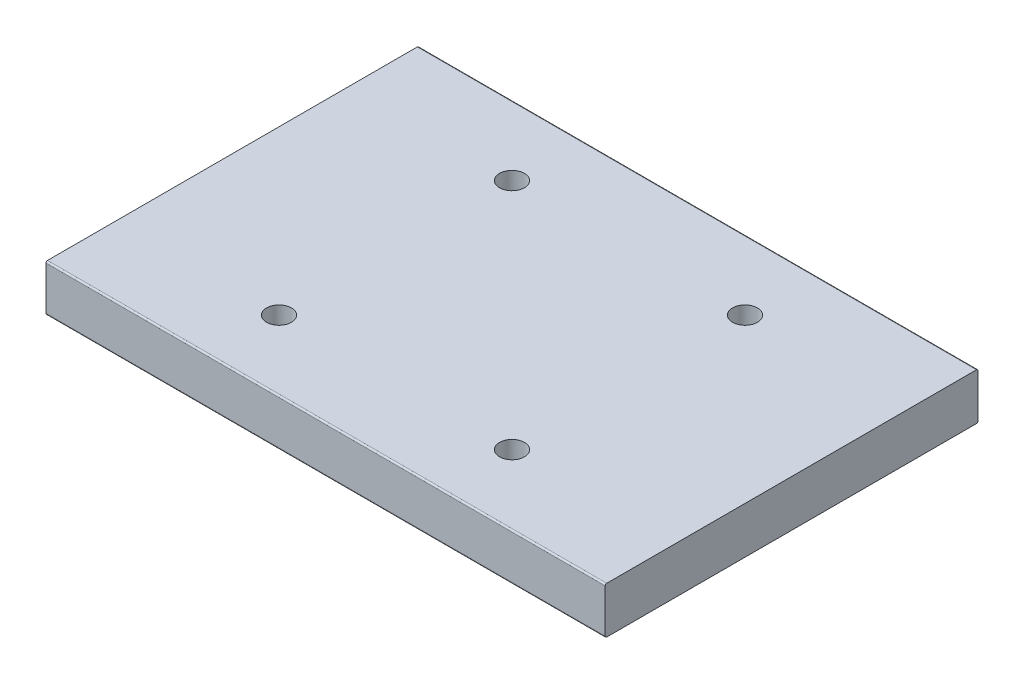
ISO-10303-21;
HEADER;
FILE_DESCRIPTION(('STEP AP214'),'2;1');
FILE_NAME('part.step','',(''),(''),'','','');
FILE_SCHEMA(('AUTOMOTIVE_DESIGN { 1 0 10303 214 1 1 1 1 }'));
ENDSEC;
DATA;
#1=APPLICATION_CONTEXT('core data for automotive mechanical design processes');
#2=APPLICATION_PROTOCOL_DEFINITION('international standard','automotive_design',2000,#1);
#3=PRODUCT_CONTEXT('',#1,'mechanical');
#4=PRODUCT('Part','Part','',(#3));
#5=PRODUCT_RELATED_PRODUCT_CATEGORY('part','',(#4));
#6=PRODUCT_DEFINITION_FORMATION('','',#4);
#7=PRODUCT_DEFINITION_CONTEXT('part definition',#1,'design');
#8=PRODUCT_DEFINITION('design','',#6,#7);
#9=PRODUCT_DEFINITION_SHAPE('','',#8);
#10=(LENGTH_UNIT() NAMED_UNIT(*) SI_UNIT(.MILLI.,.METRE.));
#11=(NAMED_UNIT(*) PLANE_ANGLE_UNIT() SI_UNIT($,.RADIAN.));
#12=(NAMED_UNIT(*) SI_UNIT($,.STERADIAN.) SOLID_ANGLE_UNIT());
#13=UNCERTAINTY_MEASURE_WITH_UNIT(LENGTH_MEASURE(1.E-05),#10,'distance_accuracy_value','');
#14=(GEOMETRIC_REPRESENTATION_CONTEXT(3) GLOBAL_UNCERTAINTY_ASSIGNED_CONTEXT((#13)) GLOBAL_UNIT_ASSIGNED_CONTEXT((#10,
#11,#12)) REPRESENTATION_CONTEXT('',''));
#15=CARTESIAN_POINT('',(0.,0.,0.));
#16=DIRECTION('',(0.,0.,1.));
#17=DIRECTION('',(1.,0.,0.));
#18=AXIS2_PLACEMENT_3D('',#15,#16,#17);
#19=CARTESIAN_POINT('',(-76.1999999999999,6.35,-50.8));
#20=DIRECTION('',(1.,0.,0.));
#21=DIRECTION('',(0.,0.,-1.));
#22=AXIS2_PLACEMENT_3D('',#19,#20,#21);
#23=PLANE('',#22);
#24=DIRECTION('',(0.,-1.,0.));
#25=VECTOR('',#24,1.);
#26=CARTESIAN_POINT('',(-76.1999999999999,6.35,-50.8));
#27=LINE('',#26,#25);
#28=CARTESIAN_POINT('',(-76.1999999999999,5.9309,-50.8));
#29=VERTEX_POINT('',#28);
#30=CARTESIAN_POINT('',(-76.1999999999999,-5.9309,-50.8));
#31=VERTEX_POINT('',#30);
#32=EDGE_CURVE('E121',#29,#31,#27,.T.);
#33=ORIENTED_EDGE('',*,*,#32,.T.);
#34=CARTESIAN_POINT('',(-76.1999999999999,-5.9309,-50.3809));
#35=DIRECTION('',(1.,0.,0.));
#36=DIRECTION('',(0.,0.,-1.));
#37=AXIS2_PLACEMENT_3D('',#34,#35,#36);
#38=CIRCLE('',#37,0.4191);
#39=CARTESIAN_POINT('',(-76.1999999999999,-6.35,-50.3809));
#40=VERTEX_POINT('',#39);
#41=EDGE_CURVE('E179',#31,#40,#38,.F.);
#42=ORIENTED_EDGE('',*,*,#41,.T.);
#43=DIRECTION('',(0.,0.,1.));
#44=VECTOR('',#43,1.);
#45=CARTESIAN_POINT('',(-76.1999999999999,-6.35,-50.8));
#46=LINE('',#45,#44);
#47=CARTESIAN_POINT('',(-76.1999999999999,-6.35,50.3809));
#48=VERTEX_POINT('',#47);
#49=EDGE_CURVE('E203',#40,#48,#46,.T.);
#50=ORIENTED_EDGE('',*,*,#49,.T.);
#51=CARTESIAN_POINT('',(-76.1999999999999,-5.9309,50.3809));
#52=DIRECTION('',(1.,0.,0.));
#53=DIRECTION('',(0.,0.,-1.));
#54=AXIS2_PLACEMENT_3D('',#51,#52,#53);
#55=CIRCLE('',#54,0.4191);
#56=CARTESIAN_POINT('',(-76.1999999999999,-5.9309,50.8));
#57=VERTEX_POINT('',#56);
#58=EDGE_CURVE('E166',#48,#57,#55,.F.);
#59=ORIENTED_EDGE('',*,*,#58,.T.);
#60=DIRECTION('',(0.,-1.,0.));
#61=VECTOR('',#60,1.);
#62=CARTESIAN_POINT('',(-76.1999999999999,6.35,50.8));
#63=LINE('',#62,#61);
#64=CARTESIAN_POINT('',(-76.1999999999999,5.9309,50.8));
#65=VERTEX_POINT('',#64);
#66=EDGE_CURVE('E125',#65,#57,#63,.T.);
#67=ORIENTED_EDGE('',*,*,#66,.F.);
#68=CARTESIAN_POINT('',(-76.1999999999999,5.9309,50.3809));
#69=DIRECTION('',(1.,0.,0.));
#70=DIRECTION('',(0.,0.,-1.));
#71=AXIS2_PLACEMENT_3D('',#68,#69,#70);
#72=CIRCLE('',#71,0.4191);
#73=CARTESIAN_POINT('',(-76.1999999999999,6.35,50.3809));
#74=VERTEX_POINT('',#73);
#75=EDGE_CURVE('E162',#65,#74,#72,.F.);
#76=ORIENTED_EDGE('',*,*,#75,.T.);
#77=DIRECTION('',(0.,0.,1.));
#78=VECTOR('',#77,1.);
#79=CARTESIAN_POINT('',(-76.1999999999999,6.35,-50.8));
#80=LINE('',#79,#78);
#81=CARTESIAN_POINT('',(-76.1999999999999,6.35,-50.3809));
#82=VERTEX_POINT('',#81);
#83=EDGE_CURVE('E191',#82,#74,#80,.T.);
#84=ORIENTED_EDGE('',*,*,#83,.F.);
#85=CARTESIAN_POINT('',(-76.1999999999999,5.9309,-50.3809));
#86=DIRECTION('',(1.,0.,0.));
#87=DIRECTION('',(0.,0.,-1.));
#88=AXIS2_PLACEMENT_3D('',#85,#86,#87);
#89=CIRCLE('',#88,0.4191);
#90=EDGE_CURVE('E173',#82,#29,#89,.F.);
#91=ORIENTED_EDGE('',*,*,#90,.T.);
#92=EDGE_LOOP('',(#33,#42,#50,#59,#67,#76,#84,#91));
#93=FACE_BOUND('',#92,.T.);
#94=ADVANCED_FACE('F45',(#93),#23,.F.);
#95=CARTESIAN_POINT('',(-76.1999999999999,6.35,50.8));
#96=DIRECTION('',(0.,0.,-1.));
#97=DIRECTION('',(-1.,0.,0.));
#98=AXIS2_PLACEMENT_3D('',#95,#96,#97);
#99=PLANE('',#98);
#100=ORIENTED_EDGE('',*,*,#66,.T.);
#101=DIRECTION('',(1.,0.,0.));
#102=VECTOR('',#101,1.);
#103=CARTESIAN_POINT('',(-76.1999999999999,-5.9309,50.8));
#104=LINE('',#103,#102);
#105=CARTESIAN_POINT('',(76.2,-5.9309,50.8));
#106=VERTEX_POINT('',#105);
#107=EDGE_CURVE('E11',#57,#106,#104,.T.);
#108=ORIENTED_EDGE('',*,*,#107,.T.);
#109=DIRECTION('',(0.,-1.,0.));
#110=VECTOR('',#109,1.);
#111=CARTESIAN_POINT('',(76.2,6.35,50.8));
#112=LINE('',#111,#110);
#113=CARTESIAN_POINT('',(76.2,5.9309,50.8));
#114=VERTEX_POINT('',#113);
#115=EDGE_CURVE('E132',#114,#106,#112,.T.);
#116=ORIENTED_EDGE('',*,*,#115,.F.);
#117=DIRECTION('',(1.,0.,0.));
#118=VECTOR('',#117,1.);
#119=CARTESIAN_POINT('',(-76.1999999999999,5.9309,50.8));
#120=LINE('',#119,#118);
#121=EDGE_CURVE('E54',#114,#65,#120,.F.);
#122=ORIENTED_EDGE('',*,*,#121,.T.);
#123=EDGE_LOOP('',(#100,#108,#116,#122));
#124=FACE_BOUND('',#123,.T.);
#125=ADVANCED_FACE('F156',(#124),#99,.F.);
#126=CARTESIAN_POINT('',(76.2,6.35,-50.8));
#127=DIRECTION('',(-1.,0.,0.));
#128=DIRECTION('',(0.,0.,1.));
#129=AXIS2_PLACEMENT_3D('',#126,#127,#128);
#130=PLANE('',#129);
#131=DIRECTION('',(0.,0.,-1.));
#132=VECTOR('',#131,1.);
#133=CARTESIAN_POINT('',(76.2,-6.35,-50.8));
#134=LINE('',#133,#132);
#135=CARTESIAN_POINT('',(76.2,-6.35,50.3809));
#136=VERTEX_POINT('',#135);
#137=CARTESIAN_POINT('',(76.2,-6.35,-50.3809));
#138=VERTEX_POINT('',#137);
#139=EDGE_CURVE('E196',#136,#138,#134,.T.);
#140=ORIENTED_EDGE('',*,*,#139,.T.);
#141=CARTESIAN_POINT('',(76.2,-5.9309,-50.3809));
#142=DIRECTION('',(-1.,0.,0.));
#143=DIRECTION('',(0.,0.,1.));
#144=AXIS2_PLACEMENT_3D('',#141,#142,#143);
#145=CIRCLE('',#144,0.4191);
#146=CARTESIAN_POINT('',(76.2,-5.9309,-50.8));
#147=VERTEX_POINT('',#146);
#148=EDGE_CURVE('E130',#138,#147,#145,.F.);
#149=ORIENTED_EDGE('',*,*,#148,.T.);
#150=DIRECTION('',(0.,-1.,0.));
#151=VECTOR('',#150,1.);
#152=CARTESIAN_POINT('',(76.2,6.35,-50.8));
#153=LINE('',#152,#151);
#154=CARTESIAN_POINT('',(76.2,5.9309,-50.8));
#155=VERTEX_POINT('',#154);
#156=EDGE_CURVE('E118',#155,#147,#153,.T.);
#157=ORIENTED_EDGE('',*,*,#156,.F.);
#158=CARTESIAN_POINT('',(76.2,5.9309,-50.3809));
#159=DIRECTION('',(-1.,0.,0.));
#160=DIRECTION('',(0.,0.,1.));
#161=AXIS2_PLACEMENT_3D('',#158,#159,#160);
#162=CIRCLE('',#161,0.4191);
#163=CARTESIAN_POINT('',(76.2,6.35,-50.3809));
#164=VERTEX_POINT('',#163);
#165=EDGE_CURVE('E61',#155,#164,#162,.F.);
#166=ORIENTED_EDGE('',*,*,#165,.T.);
#167=DIRECTION('',(0.,0.,-1.));
#168=VECTOR('',#167,1.);
#169=CARTESIAN_POINT('',(76.2,6.35,-50.8));
#170=LINE('',#169,#168);
#171=CARTESIAN_POINT('',(76.2,6.35,50.3809));
#172=VERTEX_POINT('',#171);
#173=EDGE_CURVE('E188',#172,#164,#170,.T.);
#174=ORIENTED_EDGE('',*,*,#173,.F.);
#175=CARTESIAN_POINT('',(76.2,5.9309,50.3809));
#176=DIRECTION('',(-1.,0.,0.));
#177=DIRECTION('',(0.,0.,1.));
#178=AXIS2_PLACEMENT_3D('',#175,#176,#177);
#179=CIRCLE('',#178,0.4191);
#180=EDGE_CURVE('E69',#172,#114,#179,.F.);
#181=ORIENTED_EDGE('',*,*,#180,.T.);
#182=ORIENTED_EDGE('',*,*,#115,.T.);
#183=CARTESIAN_POINT('',(76.2,-5.9309,50.3809));
#184=DIRECTION('',(-1.,0.,0.));
#185=DIRECTION('',(0.,0.,1.));
#186=AXIS2_PLACEMENT_3D('',#183,#184,#185);
#187=CIRCLE('',#186,0.4191);
#188=EDGE_CURVE('E139',#106,#136,#187,.F.);
#189=ORIENTED_EDGE('',*,*,#188,.T.);
#190=EDGE_LOOP('',(#140,#149,#157,#166,#174,#181,#182,#189));
#191=FACE_BOUND('',#190,.T.);
#192=ADVANCED_FACE('F128',(#191),#130,.F.);
#193=CARTESIAN_POINT('',(-76.1999999999999,6.35,-50.8));
#194=DIRECTION('',(0.,0.,1.));
#195=DIRECTION('',(1.,0.,0.));
#196=AXIS2_PLACEMENT_3D('',#193,#194,#195);
#197=PLANE('',#196);
#198=ORIENTED_EDGE('',*,*,#156,.T.);
#199=DIRECTION('',(-1.,0.,0.));
#200=VECTOR('',#199,1.);
#201=CARTESIAN_POINT('',(-76.1999999999999,-5.9309,-50.8));
#202=LINE('',#201,#200);
#203=EDGE_CURVE('E124',#147,#31,#202,.T.);
#204=ORIENTED_EDGE('',*,*,#203,.T.);
#205=ORIENTED_EDGE('',*,*,#32,.F.);
#206=DIRECTION('',(-1.,0.,0.));
#207=VECTOR('',#206,1.);
#208=CARTESIAN_POINT('',(76.2,5.9309,-50.8));
#209=LINE('',#208,#207);
#210=EDGE_CURVE('E115',#29,#155,#209,.F.);
#211=ORIENTED_EDGE('',*,*,#210,.T.);
#212=EDGE_LOOP('',(#198,#204,#205,#211));
#213=FACE_BOUND('',#212,.T.);
#214=ADVANCED_FACE('F116',(#213),#197,.F.);
#215=CARTESIAN_POINT('',(0.,6.35,0.));
#216=DIRECTION('',(0.,1.,0.));
#217=DIRECTION('',(0.,0.,1.));
#218=AXIS2_PLACEMENT_3D('',#215,#216,#217);
#219=PLANE('',#218);
#220=CARTESIAN_POINT('',(-31.7499999999997,6.35,-31.7500000000003));
#221=DIRECTION('',(0.,1.,0.));
#222=DIRECTION('',(0.,0.,1.));
#223=AXIS2_PLACEMENT_3D('',#220,#221,#222);
#224=CIRCLE('',#223,3.4036);
#225=CARTESIAN_POINT('',(-31.7499999999997,6.35,-28.3464000000003));
#226=VERTEX_POINT('',#225);
#227=EDGE_CURVE('E219',#226,#226,#224,.T.);
#228=ORIENTED_EDGE('',*,*,#227,.F.);
#229=EDGE_LOOP('',(#228));
#230=FACE_BOUND('',#229,.T.);
#231=CARTESIAN_POINT('',(-31.7500000000002,6.35,31.7499999999998));
#232=DIRECTION('',(0.,1.,0.));
#233=DIRECTION('',(0.,0.,1.));
#234=AXIS2_PLACEMENT_3D('',#231,#232,#233);
#235=CIRCLE('',#234,3.4036);
#236=CARTESIAN_POINT('',(-31.7500000000002,6.35,35.1535999999998));
#237=VERTEX_POINT('',#236);
#238=EDGE_CURVE('E227',#237,#237,#235,.T.);
#239=ORIENTED_EDGE('',*,*,#238,.F.);
#240=EDGE_LOOP('',(#239));
#241=FACE_BOUND('',#240,.T.);
#242=CARTESIAN_POINT('',(31.7499999999999,6.35,31.7500000000001));
#243=DIRECTION('',(0.,1.,0.));
#244=DIRECTION('',(0.,0.,1.));
#245=AXIS2_PLACEMENT_3D('',#242,#243,#244);
#246=CIRCLE('',#245,3.4036);
#247=CARTESIAN_POINT('',(31.7499999999999,6.35,35.1536000000001));
#248=VERTEX_POINT('',#247);
#249=EDGE_CURVE('E211',#248,#248,#246,.T.);
#250=ORIENTED_EDGE('',*,*,#249,.F.);
#251=EDGE_LOOP('',(#250));
#252=FACE_BOUND('',#251,.T.);
#253=CARTESIAN_POINT('',(31.75,6.35,-31.75));
#254=DIRECTION('',(0.,1.,0.));
#255=DIRECTION('',(0.,0.,1.));
#256=AXIS2_PLACEMENT_3D('',#253,#254,#255);
#257=CIRCLE('',#256,3.4036);
#258=CARTESIAN_POINT('',(31.75,6.35,-28.3464));
#259=VERTEX_POINT('',#258);
#260=EDGE_CURVE('E207',#259,#259,#257,.T.);
#261=ORIENTED_EDGE('',*,*,#260,.F.);
#262=EDGE_LOOP('',(#261));
#263=FACE_BOUND('',#262,.T.);
#264=ORIENTED_EDGE('',*,*,#173,.T.);
#265=DIRECTION('',(-1.,0.,0.));
#266=VECTOR('',#265,1.);
#267=CARTESIAN_POINT('',(-76.1999999999999,6.35,-50.3809));
#268=LINE('',#267,#266);
#269=EDGE_CURVE('E137',#164,#82,#268,.T.);
#270=ORIENTED_EDGE('',*,*,#269,.T.);
#271=ORIENTED_EDGE('',*,*,#83,.T.);
#272=DIRECTION('',(1.,0.,0.));
#273=VECTOR('',#272,1.);
#274=CARTESIAN_POINT('',(76.2,6.35,50.3809));
#275=LINE('',#274,#273);
#276=EDGE_CURVE('E143',#74,#172,#275,.T.);
#277=ORIENTED_EDGE('',*,*,#276,.T.);
#278=EDGE_LOOP('',(#264,#270,#271,#277));
#279=FACE_BOUND('',#278,.T.);
#280=ADVANCED_FACE('F241',(#230,#241,#252,#263,#279),#219,.T.);
#281=CARTESIAN_POINT('',(0.,-6.35,0.));
#282=DIRECTION('',(0.,1.,0.));
#283=DIRECTION('',(0.,0.,1.));
#284=AXIS2_PLACEMENT_3D('',#281,#282,#283);
#285=PLANE('',#284);
#286=CARTESIAN_POINT('',(-31.7499999999997,-6.35,-31.7500000000003));
#287=DIRECTION('',(0.,1.,0.));
#288=DIRECTION('',(0.,0.,1.));
#289=AXIS2_PLACEMENT_3D('',#286,#287,#288);
#290=CIRCLE('',#289,3.4036);
#291=CARTESIAN_POINT('',(-31.7499999999997,-6.35,-28.3464000000003));
#292=VERTEX_POINT('',#291);
#293=EDGE_CURVE('E215',#292,#292,#290,.T.);
#294=ORIENTED_EDGE('',*,*,#293,.T.);
#295=EDGE_LOOP('',(#294));
#296=FACE_BOUND('',#295,.T.);
#297=CARTESIAN_POINT('',(-31.7500000000002,-6.35,31.7499999999998));
#298=DIRECTION('',(0.,1.,0.));
#299=DIRECTION('',(0.,0.,1.));
#300=AXIS2_PLACEMENT_3D('',#297,#298,#299);
#301=CIRCLE('',#300,3.4036);
#302=CARTESIAN_POINT('',(-31.7500000000002,-6.35,35.1535999999998));
#303=VERTEX_POINT('',#302);
#304=EDGE_CURVE('E223',#303,#303,#301,.T.);
#305=ORIENTED_EDGE('',*,*,#304,.T.);
#306=EDGE_LOOP('',(#305));
#307=FACE_BOUND('',#306,.T.);
#308=CARTESIAN_POINT('',(31.7499999999999,-6.35,31.7500000000001));
#309=DIRECTION('',(0.,1.,0.));
#310=DIRECTION('',(0.,0.,1.));
#311=AXIS2_PLACEMENT_3D('',#308,#309,#310);
#312=CIRCLE('',#311,3.4036);
#313=CARTESIAN_POINT('',(31.7499999999999,-6.35,35.1536000000001));
#314=VERTEX_POINT('',#313);
#315=EDGE_CURVE('E231',#314,#314,#312,.T.);
#316=ORIENTED_EDGE('',*,*,#315,.T.);
#317=EDGE_LOOP('',(#316));
#318=FACE_BOUND('',#317,.T.);
#319=CARTESIAN_POINT('',(31.75,-6.35,-31.75));
#320=DIRECTION('',(0.,1.,0.));
#321=DIRECTION('',(0.,0.,1.));
#322=AXIS2_PLACEMENT_3D('',#319,#320,#321);
#323=CIRCLE('',#322,3.4036);
#324=CARTESIAN_POINT('',(31.75,-6.35,-28.3464));
#325=VERTEX_POINT('',#324);
#326=EDGE_CURVE('E206',#325,#325,#323,.T.);
#327=ORIENTED_EDGE('',*,*,#326,.T.);
#328=EDGE_LOOP('',(#327));
#329=FACE_BOUND('',#328,.T.);
#330=ORIENTED_EDGE('',*,*,#49,.F.);
#331=DIRECTION('',(-1.,0.,0.));
#332=VECTOR('',#331,1.);
#333=CARTESIAN_POINT('',(0.,-6.35,-50.3809));
#334=LINE('',#333,#332);
#335=EDGE_CURVE('E185',#40,#138,#334,.F.);
#336=ORIENTED_EDGE('',*,*,#335,.T.);
#337=ORIENTED_EDGE('',*,*,#139,.F.);
#338=DIRECTION('',(1.,0.,0.));
#339=VECTOR('',#338,1.);
#340=CARTESIAN_POINT('',(0.,-6.35,50.3809));
#341=LINE('',#340,#339);
#342=EDGE_CURVE('E182',#136,#48,#341,.F.);
#343=ORIENTED_EDGE('',*,*,#342,.T.);
#344=EDGE_LOOP('',(#330,#336,#337,#343));
#345=FACE_BOUND('',#344,.T.);
#346=ADVANCED_FACE('F244',(#296,#307,#318,#329,#345),#285,.F.);
#347=CARTESIAN_POINT('',(-76.1999999999999,-5.9309,-50.3809));
#348=DIRECTION('',(-1.,0.,0.));
#349=DIRECTION('',(0.,0.,1.));
#350=AXIS2_PLACEMENT_3D('',#347,#348,#349);
#351=CYLINDRICAL_SURFACE('',#350,0.4191);
#352=ORIENTED_EDGE('',*,*,#148,.F.);
#353=ORIENTED_EDGE('',*,*,#335,.F.);
#354=ORIENTED_EDGE('',*,*,#41,.F.);
#355=ORIENTED_EDGE('',*,*,#203,.F.);
#356=EDGE_LOOP('',(#352,#353,#354,#355));
#357=FACE_BOUND('',#356,.T.);
#358=ADVANCED_FACE('F273',(#357),#351,.T.);
#359=CARTESIAN_POINT('',(0.,5.9309,-50.3809));
#360=DIRECTION('',(1.,0.,0.));
#361=DIRECTION('',(0.,0.,-1.));
#362=AXIS2_PLACEMENT_3D('',#359,#360,#361);
#363=CYLINDRICAL_SURFACE('',#362,0.4191);
#364=ORIENTED_EDGE('',*,*,#165,.F.);
#365=ORIENTED_EDGE('',*,*,#210,.F.);
#366=ORIENTED_EDGE('',*,*,#90,.F.);
#367=ORIENTED_EDGE('',*,*,#269,.F.);
#368=EDGE_LOOP('',(#364,#365,#366,#367));
#369=FACE_BOUND('',#368,.T.);
#370=ADVANCED_FACE('F135',(#369),#363,.T.);
#371=CARTESIAN_POINT('',(-76.1999999999999,-5.9309,50.3809));
#372=DIRECTION('',(1.,0.,0.));
#373=DIRECTION('',(0.,0.,-1.));
#374=AXIS2_PLACEMENT_3D('',#371,#372,#373);
#375=CYLINDRICAL_SURFACE('',#374,0.4191);
#376=ORIENTED_EDGE('',*,*,#58,.F.);
#377=ORIENTED_EDGE('',*,*,#342,.F.);
#378=ORIENTED_EDGE('',*,*,#188,.F.);
#379=ORIENTED_EDGE('',*,*,#107,.F.);
#380=EDGE_LOOP('',(#376,#377,#378,#379));
#381=FACE_BOUND('',#380,.T.);
#382=ADVANCED_FACE('F261',(#381),#375,.T.);
#383=CARTESIAN_POINT('',(0.,5.9309,50.3809));
#384=DIRECTION('',(-1.,0.,0.));
#385=DIRECTION('',(0.,0.,1.));
#386=AXIS2_PLACEMENT_3D('',#383,#384,#385);
#387=CYLINDRICAL_SURFACE('',#386,0.4191);
#388=ORIENTED_EDGE('',*,*,#75,.F.);
#389=ORIENTED_EDGE('',*,*,#121,.F.);
#390=ORIENTED_EDGE('',*,*,#180,.F.);
#391=ORIENTED_EDGE('',*,*,#276,.F.);
#392=EDGE_LOOP('',(#388,#389,#390,#391));
#393=FACE_BOUND('',#392,.T.);
#394=ADVANCED_FACE('F47',(#393),#387,.T.);
#395=CARTESIAN_POINT('',(31.75,-6.35,-31.75));
#396=DIRECTION('',(0.,1.,0.));
#397=DIRECTION('',(0.,0.,1.));
#398=AXIS2_PLACEMENT_3D('',#395,#396,#397);
#399=CYLINDRICAL_SURFACE('',#398,3.4036);
#400=ORIENTED_EDGE('',*,*,#326,.F.);
#401=EDGE_LOOP('',(#400));
#402=FACE_BOUND('',#401,.T.);
#403=ORIENTED_EDGE('',*,*,#260,.T.);
#404=EDGE_LOOP('',(#403));
#405=FACE_BOUND('',#404,.T.);
#406=ADVANCED_FACE('F249',(#402,#405),#399,.F.);
#407=CARTESIAN_POINT('',(31.7499999999999,-6.35,31.7500000000001));
#408=DIRECTION('',(0.,1.,0.));
#409=DIRECTION('',(0.,0.,1.));
#410=AXIS2_PLACEMENT_3D('',#407,#408,#409);
#411=CYLINDRICAL_SURFACE('',#410,3.4036);
#412=ORIENTED_EDGE('',*,*,#315,.F.);
#413=EDGE_LOOP('',(#412));
#414=FACE_BOUND('',#413,.T.);
#415=ORIENTED_EDGE('',*,*,#249,.T.);
#416=EDGE_LOOP('',(#415));
#417=FACE_BOUND('',#416,.T.);
#418=ADVANCED_FACE('F239',(#414,#417),#411,.F.);
#419=CARTESIAN_POINT('',(-31.7500000000002,-6.35,31.7499999999998));
#420=DIRECTION('',(0.,1.,0.));
#421=DIRECTION('',(0.,0.,1.));
#422=AXIS2_PLACEMENT_3D('',#419,#420,#421);
#423=CYLINDRICAL_SURFACE('',#422,3.4036);
#424=ORIENTED_EDGE('',*,*,#304,.F.);
#425=EDGE_LOOP('',(#424));
#426=FACE_BOUND('',#425,.T.);
#427=ORIENTED_EDGE('',*,*,#238,.T.);
#428=EDGE_LOOP('',(#427));
#429=FACE_BOUND('',#428,.T.);
#430=ADVANCED_FACE('F257',(#426,#429),#423,.F.);
#431=CARTESIAN_POINT('',(-31.7499999999997,-6.35,-31.7500000000003));
#432=DIRECTION('',(0.,1.,0.));
#433=DIRECTION('',(0.,0.,1.));
#434=AXIS2_PLACEMENT_3D('',#431,#432,#433);
#435=CYLINDRICAL_SURFACE('',#434,3.4036);
#436=ORIENTED_EDGE('',*,*,#293,.F.);
#437=EDGE_LOOP('',(#436));
#438=FACE_BOUND('',#437,.T.);
#439=ORIENTED_EDGE('',*,*,#227,.T.);
#440=EDGE_LOOP('',(#439));
#441=FACE_BOUND('',#440,.T.);
#442=ADVANCED_FACE('F342',(#438,#441),#435,.F.);
#443=CLOSED_SHELL('',(#94,#125,#192,#214,#280,#346,#358,#370,#382,#394,#406,#418,#430,#442));
#444=MANIFOLD_SOLID_BREP('B2',#443);
#445=ADVANCED_BREP_SHAPE_REPRESENTATION('',(#18,#444),#14);
#446=SHAPE_DEFINITION_REPRESENTATION(#9,#445);
ENDSEC;
END-ISO-10303-21;
